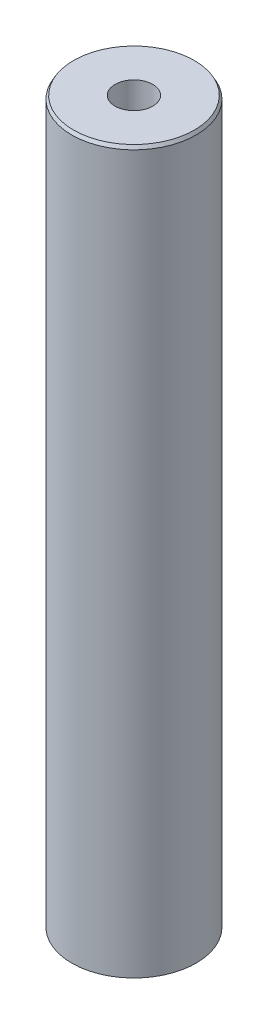
ISO-10303-21;
HEADER;
FILE_DESCRIPTION(('STEP AP214'),'2;1');
FILE_NAME('part.step','',(''),(''),'','','');
FILE_SCHEMA(('AUTOMOTIVE_DESIGN { 1 0 10303 214 1 1 1 1 }'));
ENDSEC;
DATA;
#1=APPLICATION_CONTEXT('core data for automotive mechanical design processes');
#2=APPLICATION_PROTOCOL_DEFINITION('international standard','automotive_design',2000,#1);
#3=PRODUCT_CONTEXT('',#1,'mechanical');
#4=PRODUCT('Part','Part','',(#3));
#5=PRODUCT_RELATED_PRODUCT_CATEGORY('part','',(#4));
#6=PRODUCT_DEFINITION_FORMATION('','',#4);
#7=PRODUCT_DEFINITION_CONTEXT('part definition',#1,'design');
#8=PRODUCT_DEFINITION('design','',#6,#7);
#9=PRODUCT_DEFINITION_SHAPE('','',#8);
#10=(LENGTH_UNIT() NAMED_UNIT(*) SI_UNIT(.MILLI.,.METRE.));
#11=(NAMED_UNIT(*) PLANE_ANGLE_UNIT() SI_UNIT($,.RADIAN.));
#12=(NAMED_UNIT(*) SI_UNIT($,.STERADIAN.) SOLID_ANGLE_UNIT());
#13=UNCERTAINTY_MEASURE_WITH_UNIT(LENGTH_MEASURE(1.E-05),#10,'distance_accuracy_value','');
#14=(GEOMETRIC_REPRESENTATION_CONTEXT(3) GLOBAL_UNCERTAINTY_ASSIGNED_CONTEXT((#13)) GLOBAL_UNIT_ASSIGNED_CONTEXT((#10,
#11,#12)) REPRESENTATION_CONTEXT('',''));
#15=CARTESIAN_POINT('',(0.,0.,0.));
#16=DIRECTION('',(0.,0.,1.));
#17=DIRECTION('',(1.,0.,0.));
#18=AXIS2_PLACEMENT_3D('',#15,#16,#17);
#19=CARTESIAN_POINT('',(0.,493.227366184914,0.));
#20=DIRECTION('',(0.,-1.,0.));
#21=DIRECTION('',(0.,0.,-1.));
#22=AXIS2_PLACEMENT_3D('',#19,#20,#21);
#23=CYLINDRICAL_SURFACE('',#22,42.5);
#24=CARTESIAN_POINT('',(0.,490.989009424947,0.));
#25=DIRECTION('',(0.,1.,0.));
#26=DIRECTION('',(0.,0.,1.));
#27=AXIS2_PLACEMENT_3D('',#24,#25,#26);
#28=CIRCLE('',#27,42.5);
#29=CARTESIAN_POINT('',(0.,490.989009424947,42.5));
#30=VERTEX_POINT('',#29);
#31=EDGE_CURVE('E50',#30,#30,#28,.F.);
#32=ORIENTED_EDGE('',*,*,#31,.T.);
#33=EDGE_LOOP('',(#32));
#34=FACE_BOUND('',#33,.T.);
#35=CARTESIAN_POINT('',(0.,1.29231587790918,0.));
#36=DIRECTION('',(0.,1.,0.));
#37=DIRECTION('',(0.,0.,1.));
#38=AXIS2_PLACEMENT_3D('',#35,#36,#37);
#39=CIRCLE('',#38,42.5);
#40=CARTESIAN_POINT('',(0.,1.29231587790918,42.5));
#41=VERTEX_POINT('',#40);
#42=EDGE_CURVE('E51',#41,#41,#39,.T.);
#43=ORIENTED_EDGE('',*,*,#42,.T.);
#44=EDGE_LOOP('',(#43));
#45=FACE_BOUND('',#44,.T.);
#46=ADVANCED_FACE('F39',(#34,#45),#23,.T.);
#47=CARTESIAN_POINT('',(0.,493.227366184914,0.));
#48=DIRECTION('',(0.,1.,0.));
#49=DIRECTION('',(0.,0.,1.));
#50=AXIS2_PLACEMENT_3D('',#47,#48,#49);
#51=PLANE('',#50);
#52=CARTESIAN_POINT('',(0.,493.227366184914,0.));
#53=DIRECTION('',(0.,1.,0.));
#54=DIRECTION('',(0.,0.,1.));
#55=AXIS2_PLACEMENT_3D('',#52,#53,#54);
#56=CIRCLE('',#55,41.2076841220907);
#57=CARTESIAN_POINT('',(0.,493.227366184914,41.2076841220907));
#58=VERTEX_POINT('',#57);
#59=EDGE_CURVE('E54',#58,#58,#56,.T.);
#60=ORIENTED_EDGE('',*,*,#59,.T.);
#61=EDGE_LOOP('',(#60));
#62=FACE_BOUND('',#61,.T.);
#63=CARTESIAN_POINT('',(0.,493.227366184914,0.));
#64=DIRECTION('',(0.,1.,0.));
#65=DIRECTION('',(0.,0.,1.));
#66=AXIS2_PLACEMENT_3D('',#63,#64,#65);
#67=CIRCLE('',#66,12.8854184127478);
#68=CARTESIAN_POINT('',(0.,493.227366184914,12.8854184127478));
#69=VERTEX_POINT('',#68);
#70=EDGE_CURVE('E58',#69,#69,#67,.T.);
#71=ORIENTED_EDGE('',*,*,#70,.F.);
#72=EDGE_LOOP('',(#71));
#73=FACE_BOUND('',#72,.T.);
#74=ADVANCED_FACE('F69',(#62,#73),#51,.T.);
#75=CARTESIAN_POINT('',(0.,0.,0.));
#76=DIRECTION('',(0.,1.,0.));
#77=DIRECTION('',(0.,0.,1.));
#78=AXIS2_PLACEMENT_3D('',#75,#76,#77);
#79=PLANE('',#78);
#80=CARTESIAN_POINT('',(0.,0.,0.));
#81=DIRECTION('',(0.,1.,0.));
#82=DIRECTION('',(0.,0.,1.));
#83=AXIS2_PLACEMENT_3D('',#80,#81,#82);
#84=CIRCLE('',#83,40.2616432400333);
#85=CARTESIAN_POINT('',(0.,0.,40.2616432400333));
#86=VERTEX_POINT('',#85);
#87=EDGE_CURVE('E10',#86,#86,#84,.F.);
#88=ORIENTED_EDGE('',*,*,#87,.T.);
#89=EDGE_LOOP('',(#88));
#90=FACE_BOUND('',#89,.T.);
#91=CARTESIAN_POINT('',(0.,0.,0.));
#92=DIRECTION('',(0.,1.,0.));
#93=DIRECTION('',(0.,0.,1.));
#94=AXIS2_PLACEMENT_3D('',#91,#92,#93);
#95=CIRCLE('',#94,12.8854184127478);
#96=CARTESIAN_POINT('',(0.,0.,12.8854184127478));
#97=VERTEX_POINT('',#96);
#98=EDGE_CURVE('E63',#97,#97,#95,.T.);
#99=ORIENTED_EDGE('',*,*,#98,.T.);
#100=EDGE_LOOP('',(#99));
#101=FACE_BOUND('',#100,.T.);
#102=ADVANCED_FACE('F75',(#90,#101),#79,.F.);
#103=CARTESIAN_POINT('',(0.,493.227366184914,0.));
#104=DIRECTION('',(0.,-1.,0.));
#105=DIRECTION('',(0.,0.,-1.));
#106=AXIS2_PLACEMENT_3D('',#103,#104,#105);
#107=CYLINDRICAL_SURFACE('',#106,12.8854184127478);
#108=ORIENTED_EDGE('',*,*,#70,.T.);
#109=EDGE_LOOP('',(#108));
#110=FACE_BOUND('',#109,.T.);
#111=ORIENTED_EDGE('',*,*,#98,.F.);
#112=EDGE_LOOP('',(#111));
#113=FACE_BOUND('',#112,.T.);
#114=ADVANCED_FACE('F70',(#110,#113),#107,.F.);
#115=CARTESIAN_POINT('',(0.,493.227366184914,0.));
#116=DIRECTION('',(0.,-1.,0.));
#117=DIRECTION('',(0.,0.,-1.));
#118=AXIS2_PLACEMENT_3D('',#115,#116,#117);
#119=CONICAL_SURFACE('',#118,41.2076841220907,0.523598775598301);
#120=ORIENTED_EDGE('',*,*,#31,.F.);
#121=EDGE_LOOP('',(#120));
#122=FACE_BOUND('',#121,.T.);
#123=ORIENTED_EDGE('',*,*,#59,.F.);
#124=EDGE_LOOP('',(#123));
#125=FACE_BOUND('',#124,.T.);
#126=ADVANCED_FACE('F81',(#122,#125),#119,.T.);
#127=CARTESIAN_POINT('',(0.,1.29231587790918,0.));
#128=DIRECTION('',(0.,1.,0.));
#129=DIRECTION('',(0.,0.,1.));
#130=AXIS2_PLACEMENT_3D('',#127,#128,#129);
#131=CONICAL_SURFACE('',#130,42.5,1.04719755119661);
#132=ORIENTED_EDGE('',*,*,#87,.F.);
#133=EDGE_LOOP('',(#132));
#134=FACE_BOUND('',#133,.T.);
#135=ORIENTED_EDGE('',*,*,#42,.F.);
#136=EDGE_LOOP('',(#135));
#137=FACE_BOUND('',#136,.T.);
#138=ADVANCED_FACE('F45',(#134,#137),#131,.T.);
#139=CLOSED_SHELL('',(#46,#74,#102,#114,#126,#138));
#140=MANIFOLD_SOLID_BREP('B2',#139);
#141=ADVANCED_BREP_SHAPE_REPRESENTATION('',(#18,#140),#14);
#142=SHAPE_DEFINITION_REPRESENTATION(#9,#141);
ENDSEC;
END-ISO-10303-21;
